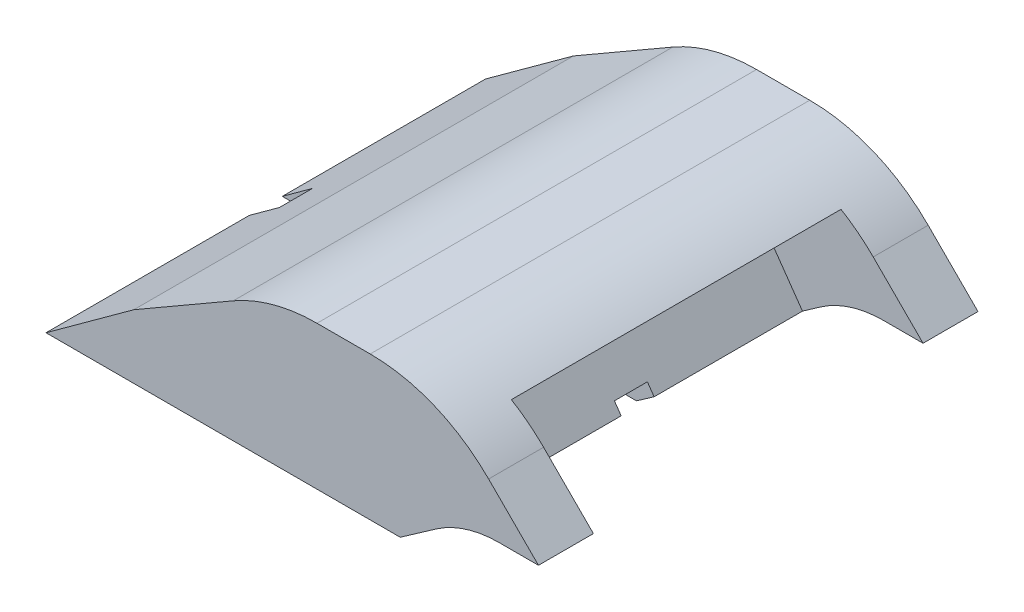
ISO-10303-21;
HEADER;
FILE_DESCRIPTION(('STEP AP214'),'2;1');
FILE_NAME('part.step','',(''),(''),'','','');
FILE_SCHEMA(('AUTOMOTIVE_DESIGN { 1 0 10303 214 1 1 1 1 }'));
ENDSEC;
DATA;
#1=APPLICATION_CONTEXT('core data for automotive mechanical design processes');
#2=APPLICATION_PROTOCOL_DEFINITION('international standard','automotive_design',2000,#1);
#3=PRODUCT_CONTEXT('',#1,'mechanical');
#4=PRODUCT('Part','Part','',(#3));
#5=PRODUCT_RELATED_PRODUCT_CATEGORY('part','',(#4));
#6=PRODUCT_DEFINITION_FORMATION('','',#4);
#7=PRODUCT_DEFINITION_CONTEXT('part definition',#1,'design');
#8=PRODUCT_DEFINITION('design','',#6,#7);
#9=PRODUCT_DEFINITION_SHAPE('','',#8);
#10=(LENGTH_UNIT() NAMED_UNIT(*) SI_UNIT(.MILLI.,.METRE.));
#11=(NAMED_UNIT(*) PLANE_ANGLE_UNIT() SI_UNIT($,.RADIAN.));
#12=(NAMED_UNIT(*) SI_UNIT($,.STERADIAN.) SOLID_ANGLE_UNIT());
#13=UNCERTAINTY_MEASURE_WITH_UNIT(LENGTH_MEASURE(1.E-05),#10,'distance_accuracy_value','');
#14=(GEOMETRIC_REPRESENTATION_CONTEXT(3) GLOBAL_UNCERTAINTY_ASSIGNED_CONTEXT((#13)) GLOBAL_UNIT_ASSIGNED_CONTEXT((#10,
#11,#12)) REPRESENTATION_CONTEXT('',''));
#15=CARTESIAN_POINT('',(0.,0.,0.));
#16=DIRECTION('',(0.,0.,1.));
#17=DIRECTION('',(1.,0.,0.));
#18=AXIS2_PLACEMENT_3D('',#15,#16,#17);
#19=CARTESIAN_POINT('',(-4.99851802359746,5.5,-43.3437705102875));
#20=DIRECTION('',(0.573576436351041,-0.819152044288996,0.));
#21=DIRECTION('',(0.819152044288996,0.573576436351041,0.));
#22=AXIS2_PLACEMENT_3D('',#19,#20,#21);
#23=PLANE('',#22);
#24=DIRECTION('',(-0.819152044288996,-0.573576436351041,0.));
#25=VECTOR('',#24,1.);
#26=CARTESIAN_POINT('',(-4.99851802359746,5.5,-9.24999999999999));
#27=LINE('',#26,#25);
#28=CARTESIAN_POINT('',(-4.19602288838293,6.06191314305383,-9.25));
#29=VERTEX_POINT('',#28);
#30=CARTESIAN_POINT('',(-4.99851802359746,5.5,-9.25));
#31=VERTEX_POINT('',#30);
#32=EDGE_CURVE('E188',#29,#31,#27,.T.);
#33=ORIENTED_EDGE('',*,*,#32,.F.);
#34=DIRECTION('',(0.,0.,1.));
#35=VECTOR('',#34,1.);
#36=CARTESIAN_POINT('',(-4.19602288838293,6.06191314305383,-43.3437705102875));
#37=LINE('',#36,#35);
#38=CARTESIAN_POINT('',(-4.19602288838293,6.06191314305383,-2.5));
#39=VERTEX_POINT('',#38);
#40=EDGE_CURVE('E266',#29,#39,#37,.T.);
#41=ORIENTED_EDGE('',*,*,#40,.T.);
#42=DIRECTION('',(0.819152044288996,0.573576436351041,0.));
#43=VECTOR('',#42,1.);
#44=CARTESIAN_POINT('',(-4.99851802359747,5.5,-2.5));
#45=LINE('',#44,#43);
#46=CARTESIAN_POINT('',(-3.37687084409393,6.63548957940487,-2.5));
#47=VERTEX_POINT('',#46);
#48=EDGE_CURVE('E289',#39,#47,#45,.T.);
#49=ORIENTED_EDGE('',*,*,#48,.T.);
#50=DIRECTION('',(0.,0.,1.));
#51=VECTOR('',#50,1.);
#52=CARTESIAN_POINT('',(-3.37687084409393,6.63548957940487,-43.3437705102875));
#53=LINE('',#52,#51);
#54=CARTESIAN_POINT('',(-3.37687084409393,6.63548957940487,0.));
#55=VERTEX_POINT('',#54);
#56=EDGE_CURVE('E230',#47,#55,#53,.T.);
#57=ORIENTED_EDGE('',*,*,#56,.T.);
#58=DIRECTION('',(0.819152044288996,0.573576436351041,0.));
#59=VECTOR('',#58,1.);
#60=CARTESIAN_POINT('',(-4.99851802359746,5.5,0.));
#61=LINE('',#60,#59);
#62=CARTESIAN_POINT('',(-4.99851802359746,5.5,0.));
#63=VERTEX_POINT('',#62);
#64=EDGE_CURVE('E329',#63,#55,#61,.T.);
#65=ORIENTED_EDGE('',*,*,#64,.F.);
#66=DIRECTION('',(0.,0.,1.));
#67=VECTOR('',#66,1.);
#68=CARTESIAN_POINT('',(-4.99851802359746,5.5,-43.3437705102875));
#69=LINE('',#68,#67);
#70=EDGE_CURVE('E234',#31,#63,#69,.T.);
#71=ORIENTED_EDGE('',*,*,#70,.F.);
#72=EDGE_LOOP('',(#33,#41,#49,#57,#65,#71));
#73=FACE_BOUND('',#72,.T.);
#74=ADVANCED_FACE('F33',(#73),#23,.T.);
#75=CARTESIAN_POINT('',(-21.1183650964577,5.5,-43.3437705102875));
#76=DIRECTION('',(0.,-1.,0.));
#77=DIRECTION('',(1.,0.,0.));
#78=AXIS2_PLACEMENT_3D('',#75,#76,#77);
#79=PLANE('',#78);
#80=DIRECTION('',(1.,0.,0.));
#81=VECTOR('',#80,1.);
#82=CARTESIAN_POINT('',(-21.1183650964577,5.5,-9.25));
#83=LINE('',#82,#81);
#84=CARTESIAN_POINT('',(-21.1183650964577,5.5,-9.25));
#85=VERTEX_POINT('',#84);
#86=EDGE_CURVE('E181',#85,#31,#83,.T.);
#87=ORIENTED_EDGE('',*,*,#86,.T.);
#88=ORIENTED_EDGE('',*,*,#70,.T.);
#89=DIRECTION('',(1.,0.,0.));
#90=VECTOR('',#89,1.);
#91=CARTESIAN_POINT('',(-21.1183650964577,5.5,0.));
#92=LINE('',#91,#90);
#93=CARTESIAN_POINT('',(-21.1183650964577,5.5,0.));
#94=VERTEX_POINT('',#93);
#95=EDGE_CURVE('E206',#94,#63,#92,.T.);
#96=ORIENTED_EDGE('',*,*,#95,.F.);
#97=DIRECTION('',(0.,0.,1.));
#98=VECTOR('',#97,1.);
#99=CARTESIAN_POINT('',(-21.1183650964577,5.5,-43.3437705102875));
#100=LINE('',#99,#98);
#101=EDGE_CURVE('E198',#85,#94,#100,.T.);
#102=ORIENTED_EDGE('',*,*,#101,.F.);
#103=EDGE_LOOP('',(#87,#88,#96,#102));
#104=FACE_BOUND('',#103,.T.);
#105=ADVANCED_FACE('F204',(#104),#79,.T.);
#106=CARTESIAN_POINT('',(-3.20935883643785,12.0397293579599,-43.3437705102875));
#107=DIRECTION('',(0.707106781186549,0.707106781186546,0.));
#108=DIRECTION('',(-0.707106781186546,0.707106781186549,0.));
#109=AXIS2_PLACEMENT_3D('',#106,#107,#108);
#110=PLANE('',#109);
#111=DIRECTION('',(0.,0.,1.));
#112=VECTOR('',#111,1.);
#113=CARTESIAN_POINT('',(-0.977512509079339,9.80788303060138,-43.3437705102875));
#114=LINE('',#113,#112);
#115=CARTESIAN_POINT('',(-0.97751250907934,9.80788303060138,-20.));
#116=VERTEX_POINT('',#115);
#117=CARTESIAN_POINT('',(-0.97751250907934,9.80788303060138,-17.5));
#118=VERTEX_POINT('',#117);
#119=EDGE_CURVE('E254',#116,#118,#114,.T.);
#120=ORIENTED_EDGE('',*,*,#119,.T.);
#121=DIRECTION('',(0.707106781186546,-0.707106781186549,0.));
#122=VECTOR('',#121,1.);
#123=CARTESIAN_POINT('',(-3.20935883643785,12.0397293579599,-17.5));
#124=LINE('',#123,#122);
#125=CARTESIAN_POINT('',(1.29064116356214,7.53972935795989,-17.5));
#126=VERTEX_POINT('',#125);
#127=EDGE_CURVE('E297',#118,#126,#124,.T.);
#128=ORIENTED_EDGE('',*,*,#127,.T.);
#129=DIRECTION('',(0.,0.,1.));
#130=VECTOR('',#129,1.);
#131=CARTESIAN_POINT('',(1.29064116356214,7.53972935795989,-43.3437705102875));
#132=LINE('',#131,#130);
#133=CARTESIAN_POINT('',(1.29064116356214,7.53972935795989,-20.));
#134=VERTEX_POINT('',#133);
#135=EDGE_CURVE('E214',#134,#126,#132,.T.);
#136=ORIENTED_EDGE('',*,*,#135,.F.);
#137=DIRECTION('',(0.707106781186546,-0.707106781186549,0.));
#138=VECTOR('',#137,1.);
#139=CARTESIAN_POINT('',(-3.20935883643785,12.0397293579599,-20.));
#140=LINE('',#139,#138);
#141=EDGE_CURVE('E317',#116,#134,#140,.T.);
#142=ORIENTED_EDGE('',*,*,#141,.F.);
#143=EDGE_LOOP('',(#120,#128,#136,#142));
#144=FACE_BOUND('',#143,.T.);
#145=ADVANCED_FACE('F371',(#144),#110,.T.);
#146=CARTESIAN_POINT('',(1.29064116356214,7.5397293579599,-2.5));
#147=VERTEX_POINT('',#146);
#148=CARTESIAN_POINT('',(1.29064116356214,7.53972935795989,0.));
#149=VERTEX_POINT('',#148);
#150=EDGE_CURVE('E222',#147,#149,#132,.T.);
#151=ORIENTED_EDGE('',*,*,#150,.F.);
#152=DIRECTION('',(-0.707106781186546,0.707106781186549,0.));
#153=VECTOR('',#152,1.);
#154=CARTESIAN_POINT('',(-3.20935883643785,12.0397293579599,-2.5));
#155=LINE('',#154,#153);
#156=CARTESIAN_POINT('',(-0.97751250907934,9.80788303060138,-2.5));
#157=VERTEX_POINT('',#156);
#158=EDGE_CURVE('E420',#147,#157,#155,.T.);
#159=ORIENTED_EDGE('',*,*,#158,.T.);
#160=CARTESIAN_POINT('',(-0.97751250907934,9.80788303060138,0.));
#161=VERTEX_POINT('',#160);
#162=EDGE_CURVE('E253',#157,#161,#114,.T.);
#163=ORIENTED_EDGE('',*,*,#162,.T.);
#164=DIRECTION('',(-0.707106781186546,0.707106781186549,0.));
#165=VECTOR('',#164,1.);
#166=CARTESIAN_POINT('',(-3.20935883643785,12.0397293579599,0.));
#167=LINE('',#166,#165);
#168=EDGE_CURVE('E338',#149,#161,#167,.T.);
#169=ORIENTED_EDGE('',*,*,#168,.F.);
#170=EDGE_LOOP('',(#151,#159,#163,#169));
#171=FACE_BOUND('',#170,.T.);
#172=ADVANCED_FACE('F435',(#171),#110,.T.);
#173=CARTESIAN_POINT('',(-0.508988662338726,7.5397293579599,-43.3437705102875));
#174=DIRECTION('',(0.,-1.,0.));
#175=DIRECTION('',(1.,0.,0.));
#176=AXIS2_PLACEMENT_3D('',#173,#174,#175);
#177=PLANE('',#176);
#178=ORIENTED_EDGE('',*,*,#135,.T.);
#179=DIRECTION('',(-1.,0.,0.));
#180=VECTOR('',#179,1.);
#181=CARTESIAN_POINT('',(-0.508988662338726,7.5397293579599,-17.5));
#182=LINE('',#181,#180);
#183=CARTESIAN_POINT('',(-0.508988662338726,7.5397293579599,-17.5));
#184=VERTEX_POINT('',#183);
#185=EDGE_CURVE('E300',#126,#184,#182,.T.);
#186=ORIENTED_EDGE('',*,*,#185,.T.);
#187=DIRECTION('',(0.,0.,1.));
#188=VECTOR('',#187,1.);
#189=CARTESIAN_POINT('',(-0.508988662338726,7.5397293579599,-43.3437705102875));
#190=LINE('',#189,#188);
#191=CARTESIAN_POINT('',(-0.508988662338726,7.5397293579599,-20.));
#192=VERTEX_POINT('',#191);
#193=EDGE_CURVE('E223',#192,#184,#190,.T.);
#194=ORIENTED_EDGE('',*,*,#193,.F.);
#195=DIRECTION('',(-1.,0.,0.));
#196=VECTOR('',#195,1.);
#197=CARTESIAN_POINT('',(-0.508988662338726,7.5397293579599,-20.));
#198=LINE('',#197,#196);
#199=EDGE_CURVE('E315',#134,#192,#198,.T.);
#200=ORIENTED_EDGE('',*,*,#199,.F.);
#201=EDGE_LOOP('',(#178,#186,#194,#200));
#202=FACE_BOUND('',#201,.T.);
#203=ADVANCED_FACE('F413',(#202),#177,.T.);
#204=CARTESIAN_POINT('',(-0.508988662338726,7.5397293579599,-2.5));
#205=VERTEX_POINT('',#204);
#206=CARTESIAN_POINT('',(-0.508988662338726,7.5397293579599,0.));
#207=VERTEX_POINT('',#206);
#208=EDGE_CURVE('E226',#205,#207,#190,.T.);
#209=ORIENTED_EDGE('',*,*,#208,.F.);
#210=DIRECTION('',(1.,0.,0.));
#211=VECTOR('',#210,1.);
#212=CARTESIAN_POINT('',(-0.508988662338734,7.5397293579599,-2.5));
#213=LINE('',#212,#211);
#214=EDGE_CURVE('E302',#205,#147,#213,.T.);
#215=ORIENTED_EDGE('',*,*,#214,.T.);
#216=ORIENTED_EDGE('',*,*,#150,.T.);
#217=DIRECTION('',(1.,0.,0.));
#218=VECTOR('',#217,1.);
#219=CARTESIAN_POINT('',(-0.508988662338726,7.5397293579599,0.));
#220=LINE('',#219,#218);
#221=EDGE_CURVE('E335',#207,#149,#220,.T.);
#222=ORIENTED_EDGE('',*,*,#221,.F.);
#223=EDGE_LOOP('',(#209,#215,#216,#222));
#224=FACE_BOUND('',#223,.T.);
#225=ADVANCED_FACE('F431',(#224),#177,.T.);
#226=CARTESIAN_POINT('',(-0.508988662338729,2.5397293579599,-43.3437705102875));
#227=DIRECTION('',(0.,0.,1.));
#228=DIRECTION('',(1.,0.,0.));
#229=AXIS2_PLACEMENT_3D('',#226,#227,#228);
#230=CYLINDRICAL_SURFACE('',#229,4.99999999999999);
#231=ORIENTED_EDGE('',*,*,#193,.T.);
#232=CARTESIAN_POINT('',(-0.508988662338729,2.5397293579599,-17.5));
#233=DIRECTION('',(0.,0.,1.));
#234=DIRECTION('',(1.,0.,0.));
#235=AXIS2_PLACEMENT_3D('',#232,#233,#234);
#236=CIRCLE('',#235,4.99999999999999);
#237=CARTESIAN_POINT('',(-3.37687084409393,6.63548957940487,-17.5));
#238=VERTEX_POINT('',#237);
#239=EDGE_CURVE('E308',#184,#238,#236,.T.);
#240=ORIENTED_EDGE('',*,*,#239,.T.);
#241=CARTESIAN_POINT('',(-3.37687084409393,6.63548957940487,-20.));
#242=VERTEX_POINT('',#241);
#243=EDGE_CURVE('E227',#242,#238,#53,.T.);
#244=ORIENTED_EDGE('',*,*,#243,.F.);
#245=CARTESIAN_POINT('',(-0.508988662338729,2.5397293579599,-20.));
#246=DIRECTION('',(0.,0.,1.));
#247=DIRECTION('',(1.,0.,0.));
#248=AXIS2_PLACEMENT_3D('',#245,#246,#247);
#249=CIRCLE('',#248,4.99999999999999);
#250=EDGE_CURVE('E212',#192,#242,#249,.T.);
#251=ORIENTED_EDGE('',*,*,#250,.F.);
#252=EDGE_LOOP('',(#231,#240,#244,#251));
#253=FACE_BOUND('',#252,.T.);
#254=ADVANCED_FACE('F383',(#253),#230,.F.);
#255=ORIENTED_EDGE('',*,*,#56,.F.);
#256=CARTESIAN_POINT('',(-0.508988662338729,2.5397293579599,-2.5));
#257=DIRECTION('',(0.,0.,-1.));
#258=DIRECTION('',(-1.,0.,0.));
#259=AXIS2_PLACEMENT_3D('',#256,#257,#258);
#260=CIRCLE('',#259,4.99999999999999);
#261=EDGE_CURVE('E296',#47,#205,#260,.T.);
#262=ORIENTED_EDGE('',*,*,#261,.T.);
#263=ORIENTED_EDGE('',*,*,#208,.T.);
#264=CARTESIAN_POINT('',(-0.508988662338729,2.5397293579599,0.));
#265=DIRECTION('',(0.,0.,-1.));
#266=DIRECTION('',(-1.,0.,0.));
#267=AXIS2_PLACEMENT_3D('',#264,#265,#266);
#268=CIRCLE('',#267,4.99999999999999);
#269=EDGE_CURVE('E332',#55,#207,#268,.T.);
#270=ORIENTED_EDGE('',*,*,#269,.F.);
#271=EDGE_LOOP('',(#255,#262,#263,#270));
#272=FACE_BOUND('',#271,.T.);
#273=ADVANCED_FACE('F376',(#272),#230,.F.);
#274=DIRECTION('',(0.819152044288996,0.573576436351041,0.));
#275=VECTOR('',#274,1.);
#276=CARTESIAN_POINT('',(-4.99851802359746,5.5,-10.75));
#277=LINE('',#276,#275);
#278=CARTESIAN_POINT('',(-4.99851802359746,5.5,-10.75));
#279=VERTEX_POINT('',#278);
#280=CARTESIAN_POINT('',(-4.19602288838293,6.06191314305383,-10.75));
#281=VERTEX_POINT('',#280);
#282=EDGE_CURVE('E48',#279,#281,#277,.T.);
#283=ORIENTED_EDGE('',*,*,#282,.F.);
#284=CARTESIAN_POINT('',(-4.99851802359746,5.5,-20.));
#285=VERTEX_POINT('',#284);
#286=EDGE_CURVE('E231',#285,#279,#69,.T.);
#287=ORIENTED_EDGE('',*,*,#286,.F.);
#288=DIRECTION('',(-0.819152044288996,-0.573576436351041,0.));
#289=VECTOR('',#288,1.);
#290=CARTESIAN_POINT('',(-4.99851802359746,5.5,-20.));
#291=LINE('',#290,#289);
#292=EDGE_CURVE('E235',#242,#285,#291,.T.);
#293=ORIENTED_EDGE('',*,*,#292,.F.);
#294=ORIENTED_EDGE('',*,*,#243,.T.);
#295=DIRECTION('',(-0.819152044288996,-0.573576436351041,0.));
#296=VECTOR('',#295,1.);
#297=CARTESIAN_POINT('',(-4.99851802359746,5.5,-17.5));
#298=LINE('',#297,#296);
#299=CARTESIAN_POINT('',(-4.19602288838293,6.06191314305383,-17.5));
#300=VERTEX_POINT('',#299);
#301=EDGE_CURVE('E311',#238,#300,#298,.T.);
#302=ORIENTED_EDGE('',*,*,#301,.T.);
#303=EDGE_CURVE('E267',#300,#281,#37,.T.);
#304=ORIENTED_EDGE('',*,*,#303,.T.);
#305=EDGE_LOOP('',(#283,#287,#293,#294,#302,#304));
#306=FACE_BOUND('',#305,.T.);
#307=ADVANCED_FACE('F367',(#306),#23,.T.);
#308=CARTESIAN_POINT('',(-6.36566618172084,4.41972935795989,-43.3437705102875));
#309=DIRECTION('',(0.,0.,1.));
#310=DIRECTION('',(1.,0.,0.));
#311=AXIS2_PLACEMENT_3D('',#308,#309,#310);
#312=CYLINDRICAL_SURFACE('',#311,7.62);
#313=DIRECTION('',(0.,0.,1.));
#314=VECTOR('',#313,1.);
#315=CARTESIAN_POINT('',(-2.44239796999294,10.9521382963872,-43.3437705102875));
#316=LINE('',#315,#314);
#317=CARTESIAN_POINT('',(-2.44239796999294,10.9521382963872,-2.5));
#318=VERTEX_POINT('',#317);
#319=CARTESIAN_POINT('',(-2.44239796999294,10.9521382963872,-17.5));
#320=VERTEX_POINT('',#319);
#321=EDGE_CURVE('E257',#318,#320,#316,.F.);
#322=ORIENTED_EDGE('',*,*,#321,.T.);
#323=CARTESIAN_POINT('',(-6.36566618172084,4.41972935795989,-17.5));
#324=DIRECTION('',(0.,0.,1.));
#325=DIRECTION('',(1.,0.,0.));
#326=AXIS2_PLACEMENT_3D('',#323,#324,#325);
#327=CIRCLE('',#326,7.62);
#328=EDGE_CURVE('E263',#320,#118,#327,.F.);
#329=ORIENTED_EDGE('',*,*,#328,.T.);
#330=ORIENTED_EDGE('',*,*,#119,.F.);
#331=CARTESIAN_POINT('',(-6.36566618172084,4.41972935795989,-20.));
#332=DIRECTION('',(0.,0.,1.));
#333=DIRECTION('',(1.,0.,0.));
#334=AXIS2_PLACEMENT_3D('',#331,#332,#333);
#335=CIRCLE('',#334,7.62);
#336=CARTESIAN_POINT('',(-6.36566618172084,12.0397293579599,-20.));
#337=VERTEX_POINT('',#336);
#338=EDGE_CURVE('E249',#337,#116,#335,.F.);
#339=ORIENTED_EDGE('',*,*,#338,.F.);
#340=DIRECTION('',(0.,0.,1.));
#341=VECTOR('',#340,1.);
#342=CARTESIAN_POINT('',(-6.36566618172084,12.0397293579599,-43.3437705102875));
#343=LINE('',#342,#341);
#344=CARTESIAN_POINT('',(-6.36566618172084,12.0397293579599,0.));
#345=VERTEX_POINT('',#344);
#346=EDGE_CURVE('E237',#345,#337,#343,.F.);
#347=ORIENTED_EDGE('',*,*,#346,.F.);
#348=CARTESIAN_POINT('',(-6.36566618172084,4.41972935795989,0.));
#349=DIRECTION('',(0.,0.,-1.));
#350=DIRECTION('',(-1.,0.,0.));
#351=AXIS2_PLACEMENT_3D('',#348,#349,#350);
#352=CIRCLE('',#351,7.62);
#353=EDGE_CURVE('E243',#161,#345,#352,.F.);
#354=ORIENTED_EDGE('',*,*,#353,.F.);
#355=ORIENTED_EDGE('',*,*,#162,.F.);
#356=CARTESIAN_POINT('',(-6.36566618172084,4.41972935795989,-2.5));
#357=DIRECTION('',(0.,0.,-1.));
#358=DIRECTION('',(-1.,0.,0.));
#359=AXIS2_PLACEMENT_3D('',#356,#357,#358);
#360=CIRCLE('',#359,7.62);
#361=EDGE_CURVE('E260',#157,#318,#360,.F.);
#362=ORIENTED_EDGE('',*,*,#361,.T.);
#363=EDGE_LOOP('',(#322,#329,#330,#339,#347,#354,#355,#362));
#364=FACE_BOUND('',#363,.T.);
#365=ADVANCED_FACE('F35',(#364),#312,.T.);
#366=DIRECTION('',(1.,0.,0.));
#367=VECTOR('',#366,1.);
#368=CARTESIAN_POINT('',(-21.1183650964577,5.5,-10.75));
#369=LINE('',#368,#367);
#370=CARTESIAN_POINT('',(-21.1183650964577,5.5,-10.75));
#371=VERTEX_POINT('',#370);
#372=EDGE_CURVE('E192',#371,#279,#369,.T.);
#373=ORIENTED_EDGE('',*,*,#372,.F.);
#374=CARTESIAN_POINT('',(-21.1183650964577,5.5,-20.));
#375=VERTEX_POINT('',#374);
#376=EDGE_CURVE('E208',#375,#371,#100,.T.);
#377=ORIENTED_EDGE('',*,*,#376,.F.);
#378=DIRECTION('',(-1.,0.,0.));
#379=VECTOR('',#378,1.);
#380=CARTESIAN_POINT('',(-21.1183650964577,5.5,-20.));
#381=LINE('',#380,#379);
#382=EDGE_CURVE('E238',#285,#375,#381,.T.);
#383=ORIENTED_EDGE('',*,*,#382,.F.);
#384=ORIENTED_EDGE('',*,*,#286,.T.);
#385=EDGE_LOOP('',(#373,#377,#383,#384));
#386=FACE_BOUND('',#385,.T.);
#387=ADVANCED_FACE('F373',(#386),#79,.T.);
#388=CARTESIAN_POINT('',(-21.1183650964577,5.5,-43.3437705102875));
#389=DIRECTION('',(-0.588129245339719,0.808766957025404,0.));
#390=DIRECTION('',(-0.808766957025404,-0.588129245339719,0.));
#391=AXIS2_PLACEMENT_3D('',#388,#389,#390);
#392=PLANE('',#391);
#393=DIRECTION('',(0.808766957025404,0.588129245339719,0.));
#394=VECTOR('',#393,1.);
#395=CARTESIAN_POINT('',(-21.1183650964577,5.5,-9.24999999999999));
#396=LINE('',#395,#394);
#397=CARTESIAN_POINT('',(-19.7432133531393,6.5,-9.25));
#398=VERTEX_POINT('',#397);
#399=EDGE_CURVE('E185',#85,#398,#396,.T.);
#400=ORIENTED_EDGE('',*,*,#399,.F.);
#401=ORIENTED_EDGE('',*,*,#101,.T.);
#402=DIRECTION('',(-0.808766957025404,-0.588129245339719,0.));
#403=VECTOR('',#402,1.);
#404=CARTESIAN_POINT('',(-21.1183650964577,5.5,0.));
#405=LINE('',#404,#403);
#406=CARTESIAN_POINT('',(-17.1183650964577,8.40876990080219,0.));
#407=VERTEX_POINT('',#406);
#408=EDGE_CURVE('E217',#407,#94,#405,.T.);
#409=ORIENTED_EDGE('',*,*,#408,.F.);
#410=DIRECTION('',(0.,0.,1.));
#411=VECTOR('',#410,1.);
#412=CARTESIAN_POINT('',(-17.1183650964577,8.40876990080219,-43.3437705102875));
#413=LINE('',#412,#411);
#414=CARTESIAN_POINT('',(-17.1183650964577,8.40876990080219,-20.));
#415=VERTEX_POINT('',#414);
#416=EDGE_CURVE('E209',#415,#407,#413,.T.);
#417=ORIENTED_EDGE('',*,*,#416,.F.);
#418=DIRECTION('',(0.808766957025404,0.588129245339719,0.));
#419=VECTOR('',#418,1.);
#420=CARTESIAN_POINT('',(-21.1183650964577,5.5,-20.));
#421=LINE('',#420,#419);
#422=EDGE_CURVE('E325',#375,#415,#421,.T.);
#423=ORIENTED_EDGE('',*,*,#422,.F.);
#424=ORIENTED_EDGE('',*,*,#376,.T.);
#425=DIRECTION('',(-0.808766957025404,-0.588129245339719,0.));
#426=VECTOR('',#425,1.);
#427=CARTESIAN_POINT('',(-21.1183650964577,5.5,-10.75));
#428=LINE('',#427,#426);
#429=CARTESIAN_POINT('',(-19.7432133531393,6.5,-10.75));
#430=VERTEX_POINT('',#429);
#431=EDGE_CURVE('E387',#430,#371,#428,.T.);
#432=ORIENTED_EDGE('',*,*,#431,.F.);
#433=DIRECTION('',(0.,0.,-1.));
#434=VECTOR('',#433,1.);
#435=CARTESIAN_POINT('',(-19.7432133531393,6.50000000000002,-43.3437705102875));
#436=LINE('',#435,#434);
#437=EDGE_CURVE('E201',#398,#430,#436,.T.);
#438=ORIENTED_EDGE('',*,*,#437,.F.);
#439=EDGE_LOOP('',(#400,#401,#409,#417,#423,#424,#432,#438));
#440=FACE_BOUND('',#439,.T.);
#441=ADVANCED_FACE('F196',(#440),#392,.T.);
#442=CARTESIAN_POINT('',(-17.1183650964577,8.40876990080219,-43.3437705102875));
#443=DIRECTION('',(-0.500000000000001,0.866025403784438,0.));
#444=DIRECTION('',(-0.866025403784438,-0.500000000000001,0.));
#445=AXIS2_PLACEMENT_3D('',#442,#443,#444);
#446=PLANE('',#445);
#447=DIRECTION('',(-0.866025403784438,-0.500000000000001,0.));
#448=VECTOR('',#447,1.);
#449=CARTESIAN_POINT('',(-17.1183650964577,8.40876990080219,0.));
#450=LINE('',#449,#448);
#451=CARTESIAN_POINT('',(-12.5975859901127,11.0188429347973,0.));
#452=VERTEX_POINT('',#451);
#453=EDGE_CURVE('E343',#452,#407,#450,.T.);
#454=ORIENTED_EDGE('',*,*,#453,.F.);
#455=DIRECTION('',(0.,0.,1.));
#456=VECTOR('',#455,1.);
#457=CARTESIAN_POINT('',(-12.5975859901127,11.0188429347973,-43.3437705102875));
#458=LINE('',#457,#456);
#459=CARTESIAN_POINT('',(-12.5975859901127,11.0188429347973,-20.));
#460=VERTEX_POINT('',#459);
#461=EDGE_CURVE('E247',#452,#460,#458,.F.);
#462=ORIENTED_EDGE('',*,*,#461,.T.);
#463=DIRECTION('',(0.866025403784438,0.500000000000001,0.));
#464=VECTOR('',#463,1.);
#465=CARTESIAN_POINT('',(-17.1183650964577,8.40876990080219,-20.));
#466=LINE('',#465,#464);
#467=EDGE_CURVE('E322',#415,#460,#466,.T.);
#468=ORIENTED_EDGE('',*,*,#467,.F.);
#469=ORIENTED_EDGE('',*,*,#416,.T.);
#470=EDGE_LOOP('',(#454,#462,#468,#469));
#471=FACE_BOUND('',#470,.T.);
#472=ADVANCED_FACE('F361',(#471),#446,.T.);
#473=CARTESIAN_POINT('',(-10.8293588364378,12.0397293579599,-43.3437705102875));
#474=DIRECTION('',(0.,1.,0.));
#475=DIRECTION('',(0.,0.,1.));
#476=AXIS2_PLACEMENT_3D('',#473,#474,#475);
#477=PLANE('',#476);
#478=DIRECTION('',(1.,0.,0.));
#479=VECTOR('',#478,1.);
#480=CARTESIAN_POINT('',(-10.8293588364378,12.0397293579599,-20.));
#481=LINE('',#480,#479);
#482=CARTESIAN_POINT('',(-8.78758599011269,12.0397293579599,-20.));
#483=VERTEX_POINT('',#482);
#484=EDGE_CURVE('E319',#483,#337,#481,.T.);
#485=ORIENTED_EDGE('',*,*,#484,.F.);
#486=DIRECTION('',(0.,0.,1.));
#487=VECTOR('',#486,1.);
#488=CARTESIAN_POINT('',(-8.78758599011269,12.0397293579599,-43.3437705102875));
#489=LINE('',#488,#487);
#490=CARTESIAN_POINT('',(-8.78758599011269,12.0397293579599,0.));
#491=VERTEX_POINT('',#490);
#492=EDGE_CURVE('E240',#483,#491,#489,.T.);
#493=ORIENTED_EDGE('',*,*,#492,.T.);
#494=DIRECTION('',(-1.,0.,0.));
#495=VECTOR('',#494,1.);
#496=CARTESIAN_POINT('',(-10.8293588364378,12.0397293579599,0.));
#497=LINE('',#496,#495);
#498=EDGE_CURVE('E341',#345,#491,#497,.T.);
#499=ORIENTED_EDGE('',*,*,#498,.F.);
#500=ORIENTED_EDGE('',*,*,#346,.T.);
#501=EDGE_LOOP('',(#485,#493,#499,#500));
#502=FACE_BOUND('',#501,.T.);
#503=ADVANCED_FACE('F352',(#502),#477,.T.);
#504=CARTESIAN_POINT('',(-0.508988662338729,2.5397293579599,0.));
#505=DIRECTION('',(0.,0.,-1.));
#506=DIRECTION('',(-1.,0.,0.));
#507=AXIS2_PLACEMENT_3D('',#504,#505,#506);
#508=PLANE('',#507);
#509=ORIENTED_EDGE('',*,*,#498,.T.);
#510=CARTESIAN_POINT('',(-8.78758599011269,4.41972935795989,0.));
#511=DIRECTION('',(0.,0.,-1.));
#512=DIRECTION('',(-1.,0.,0.));
#513=AXIS2_PLACEMENT_3D('',#510,#511,#512);
#514=CIRCLE('',#513,7.62);
#515=EDGE_CURVE('E245',#491,#452,#514,.F.);
#516=ORIENTED_EDGE('',*,*,#515,.T.);
#517=ORIENTED_EDGE('',*,*,#453,.T.);
#518=ORIENTED_EDGE('',*,*,#408,.T.);
#519=ORIENTED_EDGE('',*,*,#95,.T.);
#520=ORIENTED_EDGE('',*,*,#64,.T.);
#521=ORIENTED_EDGE('',*,*,#269,.T.);
#522=ORIENTED_EDGE('',*,*,#221,.T.);
#523=ORIENTED_EDGE('',*,*,#168,.T.);
#524=ORIENTED_EDGE('',*,*,#353,.T.);
#525=EDGE_LOOP('',(#509,#516,#517,#518,#519,#520,#521,#522,#523,#524));
#526=FACE_BOUND('',#525,.T.);
#527=ADVANCED_FACE('F348',(#526),#508,.F.);
#528=CARTESIAN_POINT('',(0.,0.,-20.));
#529=DIRECTION('',(0.,0.,1.));
#530=DIRECTION('',(1.,0.,0.));
#531=AXIS2_PLACEMENT_3D('',#528,#529,#530);
#532=PLANE('',#531);
#533=ORIENTED_EDGE('',*,*,#467,.T.);
#534=CARTESIAN_POINT('',(-8.78758599011269,4.41972935795989,-20.));
#535=DIRECTION('',(0.,0.,1.));
#536=DIRECTION('',(1.,0.,0.));
#537=AXIS2_PLACEMENT_3D('',#534,#535,#536);
#538=CIRCLE('',#537,7.62);
#539=EDGE_CURVE('E251',#460,#483,#538,.F.);
#540=ORIENTED_EDGE('',*,*,#539,.T.);
#541=ORIENTED_EDGE('',*,*,#484,.T.);
#542=ORIENTED_EDGE('',*,*,#338,.T.);
#543=ORIENTED_EDGE('',*,*,#141,.T.);
#544=ORIENTED_EDGE('',*,*,#199,.T.);
#545=ORIENTED_EDGE('',*,*,#250,.T.);
#546=ORIENTED_EDGE('',*,*,#292,.T.);
#547=ORIENTED_EDGE('',*,*,#382,.T.);
#548=ORIENTED_EDGE('',*,*,#422,.T.);
#549=EDGE_LOOP('',(#533,#540,#541,#542,#543,#544,#545,#546,#547,#548));
#550=FACE_BOUND('',#549,.T.);
#551=ADVANCED_FACE('F351',(#550),#532,.F.);
#552=CARTESIAN_POINT('',(-8.78758599011269,4.41972935795989,-43.3437705102875));
#553=DIRECTION('',(0.,0.,1.));
#554=DIRECTION('',(1.,0.,0.));
#555=AXIS2_PLACEMENT_3D('',#552,#553,#554);
#556=CYLINDRICAL_SURFACE('',#555,7.62);
#557=ORIENTED_EDGE('',*,*,#539,.F.);
#558=ORIENTED_EDGE('',*,*,#461,.F.);
#559=ORIENTED_EDGE('',*,*,#515,.F.);
#560=ORIENTED_EDGE('',*,*,#492,.F.);
#561=EDGE_LOOP('',(#557,#558,#559,#560));
#562=FACE_BOUND('',#561,.T.);
#563=ADVANCED_FACE('F358',(#562),#556,.T.);
#564=CARTESIAN_POINT('',(-2.1269528580983,3.10697490349295,-2.5));
#565=DIRECTION('',(0.819152044288996,0.573576436351041,0.));
#566=DIRECTION('',(-0.573576436351041,0.819152044288996,0.));
#567=AXIS2_PLACEMENT_3D('',#564,#565,#566);
#568=PLANE('',#567);
#569=DIRECTION('',(0.573576436351041,-0.819152044288996,0.));
#570=VECTOR('',#569,1.);
#571=CARTESIAN_POINT('',(-2.1269528580983,3.10697490349296,-9.25));
#572=LINE('',#571,#570);
#573=CARTESIAN_POINT('',(-4.50277460800723,6.5,-9.25));
#574=VERTEX_POINT('',#573);
#575=EDGE_CURVE('E11',#574,#29,#572,.T.);
#576=ORIENTED_EDGE('',*,*,#575,.F.);
#577=DIRECTION('',(0.,0.,1.));
#578=VECTOR('',#577,1.);
#579=CARTESIAN_POINT('',(-4.50277460800723,6.5,-2.5));
#580=LINE('',#579,#578);
#581=CARTESIAN_POINT('',(-4.50277460800723,6.5,-10.75));
#582=VERTEX_POINT('',#581);
#583=EDGE_CURVE('E41',#582,#574,#580,.T.);
#584=ORIENTED_EDGE('',*,*,#583,.F.);
#585=DIRECTION('',(-0.573576436351041,0.819152044288996,0.));
#586=VECTOR('',#585,1.);
#587=CARTESIAN_POINT('',(-2.1269528580983,3.10697490349296,-10.75));
#588=LINE('',#587,#586);
#589=EDGE_CURVE('E270',#281,#582,#588,.T.);
#590=ORIENTED_EDGE('',*,*,#589,.F.);
#591=ORIENTED_EDGE('',*,*,#303,.F.);
#592=DIRECTION('',(-0.573576436351041,0.819152044288996,0.));
#593=VECTOR('',#592,1.);
#594=CARTESIAN_POINT('',(-2.1269528580983,3.10697490349296,-17.5));
#595=LINE('',#594,#593);
#596=CARTESIAN_POINT('',(-5.91675219743605,8.51936927592082,-17.5));
#597=VERTEX_POINT('',#596);
#598=EDGE_CURVE('E419',#300,#597,#595,.T.);
#599=ORIENTED_EDGE('',*,*,#598,.T.);
#600=DIRECTION('',(0.,0.,-1.));
#601=VECTOR('',#600,1.);
#602=CARTESIAN_POINT('',(-5.91675219743605,8.51936927592082,-2.5));
#603=LINE('',#602,#601);
#604=CARTESIAN_POINT('',(-5.91675219743605,8.51936927592082,-2.5));
#605=VERTEX_POINT('',#604);
#606=EDGE_CURVE('E202',#605,#597,#603,.T.);
#607=ORIENTED_EDGE('',*,*,#606,.F.);
#608=DIRECTION('',(-0.573576436351041,0.819152044288996,0.));
#609=VECTOR('',#608,1.);
#610=CARTESIAN_POINT('',(-2.1269528580983,3.10697490349295,-2.5));
#611=LINE('',#610,#609);
#612=EDGE_CURVE('E285',#39,#605,#611,.T.);
#613=ORIENTED_EDGE('',*,*,#612,.F.);
#614=ORIENTED_EDGE('',*,*,#40,.F.);
#615=EDGE_LOOP('',(#576,#584,#590,#591,#599,#607,#613,#614));
#616=FACE_BOUND('',#615,.T.);
#617=ADVANCED_FACE('F282',(#616),#568,.T.);
#618=CARTESIAN_POINT('',(-2.1269528580983,3.10697490349296,-17.5));
#619=DIRECTION('',(0.,0.,1.));
#620=DIRECTION('',(1.,0.,0.));
#621=AXIS2_PLACEMENT_3D('',#618,#619,#620);
#622=PLANE('',#621);
#623=ORIENTED_EDGE('',*,*,#239,.F.);
#624=ORIENTED_EDGE('',*,*,#185,.F.);
#625=ORIENTED_EDGE('',*,*,#127,.F.);
#626=ORIENTED_EDGE('',*,*,#328,.F.);
#627=DIRECTION('',(0.819152044288995,0.573576436351041,0.));
#628=VECTOR('',#627,1.);
#629=CARTESIAN_POINT('',(-5.91675219743605,8.51936927592082,-17.5));
#630=LINE('',#629,#628);
#631=EDGE_CURVE('E56',#597,#320,#630,.T.);
#632=ORIENTED_EDGE('',*,*,#631,.F.);
#633=ORIENTED_EDGE('',*,*,#598,.F.);
#634=ORIENTED_EDGE('',*,*,#301,.F.);
#635=EDGE_LOOP('',(#623,#624,#625,#626,#632,#633,#634));
#636=FACE_BOUND('',#635,.T.);
#637=ADVANCED_FACE('F418',(#636),#622,.T.);
#638=CARTESIAN_POINT('',(-2.1269528580983,3.10697490349295,-2.5));
#639=DIRECTION('',(0.,0.,-1.));
#640=DIRECTION('',(-1.,0.,0.));
#641=AXIS2_PLACEMENT_3D('',#638,#639,#640);
#642=PLANE('',#641);
#643=ORIENTED_EDGE('',*,*,#612,.T.);
#644=DIRECTION('',(-0.819152044288996,-0.573576436351041,0.));
#645=VECTOR('',#644,1.);
#646=CARTESIAN_POINT('',(-5.91675219743605,8.51936927592082,-2.5));
#647=LINE('',#646,#645);
#648=EDGE_CURVE('E424',#318,#605,#647,.T.);
#649=ORIENTED_EDGE('',*,*,#648,.F.);
#650=ORIENTED_EDGE('',*,*,#361,.F.);
#651=ORIENTED_EDGE('',*,*,#158,.F.);
#652=ORIENTED_EDGE('',*,*,#214,.F.);
#653=ORIENTED_EDGE('',*,*,#261,.F.);
#654=ORIENTED_EDGE('',*,*,#48,.F.);
#655=EDGE_LOOP('',(#643,#649,#650,#651,#652,#653,#654));
#656=FACE_BOUND('',#655,.T.);
#657=ADVANCED_FACE('F292',(#656),#642,.T.);
#658=CARTESIAN_POINT('',(-5.94934610258969,8.49654677783255,0.));
#659=DIRECTION('',(0.573576436351041,-0.819152044288995,0.));
#660=DIRECTION('',(0.819152044288995,0.573576436351041,0.));
#661=AXIS2_PLACEMENT_3D('',#658,#659,#660);
#662=PLANE('',#661);
#663=ORIENTED_EDGE('',*,*,#648,.T.);
#664=ORIENTED_EDGE('',*,*,#606,.T.);
#665=ORIENTED_EDGE('',*,*,#631,.T.);
#666=ORIENTED_EDGE('',*,*,#321,.F.);
#667=EDGE_LOOP('',(#663,#664,#665,#666));
#668=FACE_BOUND('',#667,.T.);
#669=ADVANCED_FACE('F454',(#668),#662,.T.);
#670=CARTESIAN_POINT('',(-21.1183650964577,5.5,-9.25));
#671=DIRECTION('',(0.,0.,1.));
#672=DIRECTION('',(1.,0.,0.));
#673=AXIS2_PLACEMENT_3D('',#670,#671,#672);
#674=PLANE('',#673);
#675=ORIENTED_EDGE('',*,*,#399,.T.);
#676=DIRECTION('',(1.,0.,0.));
#677=VECTOR('',#676,1.);
#678=CARTESIAN_POINT('',(-21.1183650964577,6.5,-9.25));
#679=LINE('',#678,#677);
#680=EDGE_CURVE('E275',#398,#574,#679,.T.);
#681=ORIENTED_EDGE('',*,*,#680,.T.);
#682=ORIENTED_EDGE('',*,*,#575,.T.);
#683=ORIENTED_EDGE('',*,*,#32,.T.);
#684=ORIENTED_EDGE('',*,*,#86,.F.);
#685=EDGE_LOOP('',(#675,#681,#682,#683,#684));
#686=FACE_BOUND('',#685,.T.);
#687=ADVANCED_FACE('F183',(#686),#674,.F.);
#688=CARTESIAN_POINT('',(-21.1183650964577,6.5,-9.25));
#689=DIRECTION('',(0.,1.,0.));
#690=DIRECTION('',(0.,0.,1.));
#691=AXIS2_PLACEMENT_3D('',#688,#689,#690);
#692=PLANE('',#691);
#693=ORIENTED_EDGE('',*,*,#437,.T.);
#694=DIRECTION('',(1.,0.,0.));
#695=VECTOR('',#694,1.);
#696=CARTESIAN_POINT('',(-21.1183650964577,6.5,-10.75));
#697=LINE('',#696,#695);
#698=EDGE_CURVE('E277',#430,#582,#697,.T.);
#699=ORIENTED_EDGE('',*,*,#698,.T.);
#700=ORIENTED_EDGE('',*,*,#583,.T.);
#701=ORIENTED_EDGE('',*,*,#680,.F.);
#702=EDGE_LOOP('',(#693,#699,#700,#701));
#703=FACE_BOUND('',#702,.T.);
#704=ADVANCED_FACE('F274',(#703),#692,.F.);
#705=CARTESIAN_POINT('',(-21.1183650964577,5.5,-10.75));
#706=DIRECTION('',(0.,0.,-1.));
#707=DIRECTION('',(-1.,0.,0.));
#708=AXIS2_PLACEMENT_3D('',#705,#706,#707);
#709=PLANE('',#708);
#710=ORIENTED_EDGE('',*,*,#431,.T.);
#711=ORIENTED_EDGE('',*,*,#372,.T.);
#712=ORIENTED_EDGE('',*,*,#282,.T.);
#713=ORIENTED_EDGE('',*,*,#589,.T.);
#714=ORIENTED_EDGE('',*,*,#698,.F.);
#715=EDGE_LOOP('',(#710,#711,#712,#713,#714));
#716=FACE_BOUND('',#715,.T.);
#717=ADVANCED_FACE('F444',(#716),#709,.F.);
#718=CLOSED_SHELL('',(#74,#105,#145,#172,#203,#225,#254,#273,#307,#365,#387,#441,#472,#503,#527,
#551,#563,#617,#637,#657,#669,#687,#704,#717));
#719=MANIFOLD_SOLID_BREP('B2',#718);
#720=ADVANCED_BREP_SHAPE_REPRESENTATION('',(#18,#719),#14);
#721=SHAPE_DEFINITION_REPRESENTATION(#9,#720);
ENDSEC;
END-ISO-10303-21;
